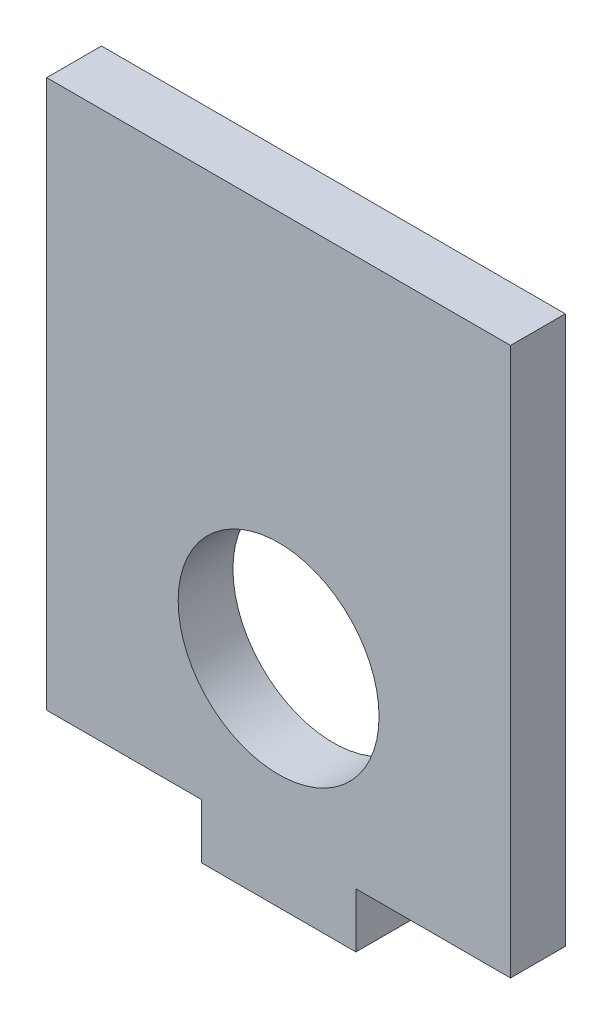
ISO-10303-21;
HEADER;
FILE_DESCRIPTION(('STEP AP214'),'2;1');
FILE_NAME('part.step','',(''),(''),'','','');
FILE_SCHEMA(('AUTOMOTIVE_DESIGN { 1 0 10303 214 1 1 1 1 }'));
ENDSEC;
DATA;
#1=APPLICATION_CONTEXT('core data for automotive mechanical design processes');
#2=APPLICATION_PROTOCOL_DEFINITION('international standard','automotive_design',2000,#1);
#3=PRODUCT_CONTEXT('',#1,'mechanical');
#4=PRODUCT('Part','Part','',(#3));
#5=PRODUCT_RELATED_PRODUCT_CATEGORY('part','',(#4));
#6=PRODUCT_DEFINITION_FORMATION('','',#4);
#7=PRODUCT_DEFINITION_CONTEXT('part definition',#1,'design');
#8=PRODUCT_DEFINITION('design','',#6,#7);
#9=PRODUCT_DEFINITION_SHAPE('','',#8);
#10=(LENGTH_UNIT() NAMED_UNIT(*) SI_UNIT(.MILLI.,.METRE.));
#11=(NAMED_UNIT(*) PLANE_ANGLE_UNIT() SI_UNIT($,.RADIAN.));
#12=(NAMED_UNIT(*) SI_UNIT($,.STERADIAN.) SOLID_ANGLE_UNIT());
#13=UNCERTAINTY_MEASURE_WITH_UNIT(LENGTH_MEASURE(1.E-05),#10,'distance_accuracy_value','');
#14=(GEOMETRIC_REPRESENTATION_CONTEXT(3) GLOBAL_UNCERTAINTY_ASSIGNED_CONTEXT((#13)) GLOBAL_UNIT_ASSIGNED_CONTEXT((#10,
#11,#12)) REPRESENTATION_CONTEXT('',''));
#15=CARTESIAN_POINT('',(0.,0.,0.));
#16=DIRECTION('',(0.,0.,1.));
#17=DIRECTION('',(1.,0.,0.));
#18=AXIS2_PLACEMENT_3D('',#15,#16,#17);
#19=CARTESIAN_POINT('',(0.,0.,6.));
#20=DIRECTION('',(0.,0.,-1.));
#21=DIRECTION('',(-1.,0.,0.));
#22=AXIS2_PLACEMENT_3D('',#19,#20,#21);
#23=PLANE('',#22);
#24=DIRECTION('',(1.,0.,0.));
#25=VECTOR('',#24,1.);
#26=CARTESIAN_POINT('',(-350.716937195697,225.798518153976,6.));
#27=LINE('',#26,#25);
#28=CARTESIAN_POINT('',(-350.716937195697,225.798518153976,6.));
#29=VERTEX_POINT('',#28);
#30=CARTESIAN_POINT('',(-333.783603862363,225.798518153976,6.));
#31=VERTEX_POINT('',#30);
#32=EDGE_CURVE('E144',#29,#31,#27,.T.);
#33=ORIENTED_EDGE('',*,*,#32,.T.);
#34=DIRECTION('',(0.,-1.,0.));
#35=VECTOR('',#34,1.);
#36=CARTESIAN_POINT('',(-333.783603862363,225.798518153976,6.));
#37=LINE('',#36,#35);
#38=CARTESIAN_POINT('',(-333.783603862363,219.798518153976,6.));
#39=VERTEX_POINT('',#38);
#40=EDGE_CURVE('E92',#31,#39,#37,.T.);
#41=ORIENTED_EDGE('',*,*,#40,.T.);
#42=DIRECTION('',(1.,0.,0.));
#43=VECTOR('',#42,1.);
#44=CARTESIAN_POINT('',(-333.783603862363,219.798518153976,6.));
#45=LINE('',#44,#43);
#46=CARTESIAN_POINT('',(-316.85027052903,219.798518153976,6.));
#47=VERTEX_POINT('',#46);
#48=EDGE_CURVE('E159',#39,#47,#45,.T.);
#49=ORIENTED_EDGE('',*,*,#48,.T.);
#50=DIRECTION('',(0.,1.,0.));
#51=VECTOR('',#50,1.);
#52=CARTESIAN_POINT('',(-316.85027052903,219.798518153976,6.));
#53=LINE('',#52,#51);
#54=CARTESIAN_POINT('',(-316.85027052903,225.798518153976,6.));
#55=VERTEX_POINT('',#54);
#56=EDGE_CURVE('E172',#47,#55,#53,.T.);
#57=ORIENTED_EDGE('',*,*,#56,.T.);
#58=DIRECTION('',(1.,0.,0.));
#59=VECTOR('',#58,1.);
#60=CARTESIAN_POINT('',(-316.85027052903,225.798518153976,6.));
#61=LINE('',#60,#59);
#62=CARTESIAN_POINT('',(-299.916937195697,225.798518153976,6.));
#63=VERTEX_POINT('',#62);
#64=EDGE_CURVE('E111',#55,#63,#61,.T.);
#65=ORIENTED_EDGE('',*,*,#64,.T.);
#66=DIRECTION('',(0.,1.,0.));
#67=VECTOR('',#66,1.);
#68=CARTESIAN_POINT('',(-299.916937195697,225.798518153976,6.));
#69=LINE('',#68,#67);
#70=CARTESIAN_POINT('',(-299.916937195697,285.798518153976,6.));
#71=VERTEX_POINT('',#70);
#72=EDGE_CURVE('E105',#63,#71,#69,.T.);
#73=ORIENTED_EDGE('',*,*,#72,.T.);
#74=DIRECTION('',(-1.,0.,0.));
#75=VECTOR('',#74,1.);
#76=CARTESIAN_POINT('',(-299.916937195697,285.798518153976,6.));
#77=LINE('',#76,#75);
#78=CARTESIAN_POINT('',(-350.716937195697,285.798518153976,6.));
#79=VERTEX_POINT('',#78);
#80=EDGE_CURVE('E109',#71,#79,#77,.T.);
#81=ORIENTED_EDGE('',*,*,#80,.T.);
#82=DIRECTION('',(0.,-1.,0.));
#83=VECTOR('',#82,1.);
#84=CARTESIAN_POINT('',(-350.716937195697,225.798518153976,6.));
#85=LINE('',#84,#83);
#86=EDGE_CURVE('E49',#79,#29,#85,.T.);
#87=ORIENTED_EDGE('',*,*,#86,.T.);
#88=EDGE_LOOP('',(#33,#41,#49,#57,#65,#73,#81,#87));
#89=FACE_BOUND('',#88,.T.);
#90=CARTESIAN_POINT('',(-325.316937195697,243.398518153976,6.));
#91=DIRECTION('',(0.,0.,1.));
#92=DIRECTION('',(1.,0.,0.));
#93=AXIS2_PLACEMENT_3D('',#90,#91,#92);
#94=CIRCLE('',#93,11.);
#95=CARTESIAN_POINT('',(-314.316937195697,243.398518153976,6.));
#96=VERTEX_POINT('',#95);
#97=EDGE_CURVE('E133',#96,#96,#94,.T.);
#98=ORIENTED_EDGE('',*,*,#97,.F.);
#99=EDGE_LOOP('',(#98));
#100=FACE_BOUND('',#99,.T.);
#101=ADVANCED_FACE('F32',(#89,#100),#23,.F.);
#102=CARTESIAN_POINT('',(0.,0.,0.));
#103=DIRECTION('',(0.,0.,-1.));
#104=DIRECTION('',(-1.,0.,0.));
#105=AXIS2_PLACEMENT_3D('',#102,#103,#104);
#106=PLANE('',#105);
#107=DIRECTION('',(1.,0.,0.));
#108=VECTOR('',#107,1.);
#109=CARTESIAN_POINT('',(-350.716937195697,225.798518153976,0.));
#110=LINE('',#109,#108);
#111=CARTESIAN_POINT('',(-350.716937195697,225.798518153976,0.));
#112=VERTEX_POINT('',#111);
#113=CARTESIAN_POINT('',(-333.783603862363,225.798518153976,0.));
#114=VERTEX_POINT('',#113);
#115=EDGE_CURVE('E129',#112,#114,#110,.T.);
#116=ORIENTED_EDGE('',*,*,#115,.F.);
#117=DIRECTION('',(0.,-1.,0.));
#118=VECTOR('',#117,1.);
#119=CARTESIAN_POINT('',(-350.716937195697,225.798518153976,0.));
#120=LINE('',#119,#118);
#121=CARTESIAN_POINT('',(-350.716937195697,285.798518153976,0.));
#122=VERTEX_POINT('',#121);
#123=EDGE_CURVE('E84',#122,#112,#120,.T.);
#124=ORIENTED_EDGE('',*,*,#123,.F.);
#125=DIRECTION('',(-1.,0.,0.));
#126=VECTOR('',#125,1.);
#127=CARTESIAN_POINT('',(-299.916937195697,285.798518153976,0.));
#128=LINE('',#127,#126);
#129=CARTESIAN_POINT('',(-299.916937195697,285.798518153976,0.));
#130=VERTEX_POINT('',#129);
#131=EDGE_CURVE('E78',#130,#122,#128,.T.);
#132=ORIENTED_EDGE('',*,*,#131,.F.);
#133=DIRECTION('',(0.,1.,0.));
#134=VECTOR('',#133,1.);
#135=CARTESIAN_POINT('',(-299.916937195697,225.798518153976,0.));
#136=LINE('',#135,#134);
#137=CARTESIAN_POINT('',(-299.916937195697,225.798518153976,0.));
#138=VERTEX_POINT('',#137);
#139=EDGE_CURVE('E119',#138,#130,#136,.T.);
#140=ORIENTED_EDGE('',*,*,#139,.F.);
#141=DIRECTION('',(1.,0.,0.));
#142=VECTOR('',#141,1.);
#143=CARTESIAN_POINT('',(-316.85027052903,225.798518153976,0.));
#144=LINE('',#143,#142);
#145=CARTESIAN_POINT('',(-316.85027052903,225.798518153976,0.));
#146=VERTEX_POINT('',#145);
#147=EDGE_CURVE('E139',#146,#138,#144,.T.);
#148=ORIENTED_EDGE('',*,*,#147,.F.);
#149=DIRECTION('',(0.,1.,0.));
#150=VECTOR('',#149,1.);
#151=CARTESIAN_POINT('',(-316.85027052903,219.798518153976,0.));
#152=LINE('',#151,#150);
#153=CARTESIAN_POINT('',(-316.85027052903,219.798518153976,0.));
#154=VERTEX_POINT('',#153);
#155=EDGE_CURVE('E137',#154,#146,#152,.T.);
#156=ORIENTED_EDGE('',*,*,#155,.F.);
#157=DIRECTION('',(1.,0.,0.));
#158=VECTOR('',#157,1.);
#159=CARTESIAN_POINT('',(-333.783603862363,219.798518153976,0.));
#160=LINE('',#159,#158);
#161=CARTESIAN_POINT('',(-333.783603862363,219.798518153976,0.));
#162=VERTEX_POINT('',#161);
#163=EDGE_CURVE('E135',#162,#154,#160,.T.);
#164=ORIENTED_EDGE('',*,*,#163,.F.);
#165=DIRECTION('',(0.,-1.,0.));
#166=VECTOR('',#165,1.);
#167=CARTESIAN_POINT('',(-333.783603862363,225.798518153976,0.));
#168=LINE('',#167,#166);
#169=EDGE_CURVE('E132',#114,#162,#168,.T.);
#170=ORIENTED_EDGE('',*,*,#169,.F.);
#171=EDGE_LOOP('',(#116,#124,#132,#140,#148,#156,#164,#170));
#172=FACE_BOUND('',#171,.T.);
#173=CARTESIAN_POINT('',(-325.316937195697,243.398518153976,0.));
#174=DIRECTION('',(0.,0.,1.));
#175=DIRECTION('',(1.,0.,0.));
#176=AXIS2_PLACEMENT_3D('',#173,#174,#175);
#177=CIRCLE('',#176,11.);
#178=CARTESIAN_POINT('',(-314.316937195697,243.398518153976,0.));
#179=VERTEX_POINT('',#178);
#180=EDGE_CURVE('E178',#179,#179,#177,.T.);
#181=ORIENTED_EDGE('',*,*,#180,.T.);
#182=EDGE_LOOP('',(#181));
#183=FACE_BOUND('',#182,.T.);
#184=ADVANCED_FACE('F163',(#172,#183),#106,.T.);
#185=CARTESIAN_POINT('',(-350.716937195697,225.798518153976,6.));
#186=DIRECTION('',(0.,1.,0.));
#187=DIRECTION('',(0.,0.,1.));
#188=AXIS2_PLACEMENT_3D('',#185,#186,#187);
#189=PLANE('',#188);
#190=ORIENTED_EDGE('',*,*,#115,.T.);
#191=DIRECTION('',(0.,0.,-1.));
#192=VECTOR('',#191,1.);
#193=CARTESIAN_POINT('',(-333.783603862363,225.798518153976,6.));
#194=LINE('',#193,#192);
#195=EDGE_CURVE('E11',#31,#114,#194,.T.);
#196=ORIENTED_EDGE('',*,*,#195,.F.);
#197=ORIENTED_EDGE('',*,*,#32,.F.);
#198=DIRECTION('',(0.,0.,-1.));
#199=VECTOR('',#198,1.);
#200=CARTESIAN_POINT('',(-350.716937195697,225.798518153976,6.));
#201=LINE('',#200,#199);
#202=EDGE_CURVE('E125',#29,#112,#201,.T.);
#203=ORIENTED_EDGE('',*,*,#202,.T.);
#204=EDGE_LOOP('',(#190,#196,#197,#203));
#205=FACE_BOUND('',#204,.T.);
#206=ADVANCED_FACE('F34',(#205),#189,.F.);
#207=CARTESIAN_POINT('',(-333.783603862363,225.798518153976,6.));
#208=DIRECTION('',(1.,0.,0.));
#209=DIRECTION('',(0.,0.,-1.));
#210=AXIS2_PLACEMENT_3D('',#207,#208,#209);
#211=PLANE('',#210);
#212=ORIENTED_EDGE('',*,*,#169,.T.);
#213=DIRECTION('',(0.,0.,-1.));
#214=VECTOR('',#213,1.);
#215=CARTESIAN_POINT('',(-333.783603862363,219.798518153976,6.));
#216=LINE('',#215,#214);
#217=EDGE_CURVE('E41',#39,#162,#216,.T.);
#218=ORIENTED_EDGE('',*,*,#217,.F.);
#219=ORIENTED_EDGE('',*,*,#40,.F.);
#220=ORIENTED_EDGE('',*,*,#195,.T.);
#221=EDGE_LOOP('',(#212,#218,#219,#220));
#222=FACE_BOUND('',#221,.T.);
#223=ADVANCED_FACE('F206',(#222),#211,.F.);
#224=CARTESIAN_POINT('',(-333.783603862363,219.798518153976,6.));
#225=DIRECTION('',(0.,1.,0.));
#226=DIRECTION('',(0.,0.,1.));
#227=AXIS2_PLACEMENT_3D('',#224,#225,#226);
#228=PLANE('',#227);
#229=ORIENTED_EDGE('',*,*,#163,.T.);
#230=DIRECTION('',(0.,0.,-1.));
#231=VECTOR('',#230,1.);
#232=CARTESIAN_POINT('',(-316.85027052903,219.798518153976,6.));
#233=LINE('',#232,#231);
#234=EDGE_CURVE('E151',#47,#154,#233,.T.);
#235=ORIENTED_EDGE('',*,*,#234,.F.);
#236=ORIENTED_EDGE('',*,*,#48,.F.);
#237=ORIENTED_EDGE('',*,*,#217,.T.);
#238=EDGE_LOOP('',(#229,#235,#236,#237));
#239=FACE_BOUND('',#238,.T.);
#240=ADVANCED_FACE('F157',(#239),#228,.F.);
#241=CARTESIAN_POINT('',(-316.85027052903,219.798518153976,6.));
#242=DIRECTION('',(-1.,0.,0.));
#243=DIRECTION('',(0.,0.,1.));
#244=AXIS2_PLACEMENT_3D('',#241,#242,#243);
#245=PLANE('',#244);
#246=ORIENTED_EDGE('',*,*,#155,.T.);
#247=DIRECTION('',(0.,0.,-1.));
#248=VECTOR('',#247,1.);
#249=CARTESIAN_POINT('',(-316.85027052903,225.798518153976,6.));
#250=LINE('',#249,#248);
#251=EDGE_CURVE('E148',#55,#146,#250,.T.);
#252=ORIENTED_EDGE('',*,*,#251,.F.);
#253=ORIENTED_EDGE('',*,*,#56,.F.);
#254=ORIENTED_EDGE('',*,*,#234,.T.);
#255=EDGE_LOOP('',(#246,#252,#253,#254));
#256=FACE_BOUND('',#255,.T.);
#257=ADVANCED_FACE('F168',(#256),#245,.F.);
#258=CARTESIAN_POINT('',(-316.85027052903,225.798518153976,6.));
#259=DIRECTION('',(0.,1.,0.));
#260=DIRECTION('',(0.,0.,1.));
#261=AXIS2_PLACEMENT_3D('',#258,#259,#260);
#262=PLANE('',#261);
#263=ORIENTED_EDGE('',*,*,#147,.T.);
#264=DIRECTION('',(0.,0.,-1.));
#265=VECTOR('',#264,1.);
#266=CARTESIAN_POINT('',(-299.916937195697,225.798518153976,6.));
#267=LINE('',#266,#265);
#268=EDGE_CURVE('E120',#63,#138,#267,.T.);
#269=ORIENTED_EDGE('',*,*,#268,.F.);
#270=ORIENTED_EDGE('',*,*,#64,.F.);
#271=ORIENTED_EDGE('',*,*,#251,.T.);
#272=EDGE_LOOP('',(#263,#269,#270,#271));
#273=FACE_BOUND('',#272,.T.);
#274=ADVANCED_FACE('F171',(#273),#262,.F.);
#275=CARTESIAN_POINT('',(-299.916937195697,225.798518153976,6.));
#276=DIRECTION('',(-1.,0.,0.));
#277=DIRECTION('',(0.,0.,1.));
#278=AXIS2_PLACEMENT_3D('',#275,#276,#277);
#279=PLANE('',#278);
#280=ORIENTED_EDGE('',*,*,#139,.T.);
#281=DIRECTION('',(0.,0.,-1.));
#282=VECTOR('',#281,1.);
#283=CARTESIAN_POINT('',(-299.916937195697,285.798518153976,6.));
#284=LINE('',#283,#282);
#285=EDGE_CURVE('E116',#71,#130,#284,.T.);
#286=ORIENTED_EDGE('',*,*,#285,.F.);
#287=ORIENTED_EDGE('',*,*,#72,.F.);
#288=ORIENTED_EDGE('',*,*,#268,.T.);
#289=EDGE_LOOP('',(#280,#286,#287,#288));
#290=FACE_BOUND('',#289,.T.);
#291=ADVANCED_FACE('F117',(#290),#279,.F.);
#292=CARTESIAN_POINT('',(-299.916937195697,285.798518153976,6.));
#293=DIRECTION('',(0.,-1.,0.));
#294=DIRECTION('',(0.,0.,-1.));
#295=AXIS2_PLACEMENT_3D('',#292,#293,#294);
#296=PLANE('',#295);
#297=ORIENTED_EDGE('',*,*,#131,.T.);
#298=DIRECTION('',(0.,0.,-1.));
#299=VECTOR('',#298,1.);
#300=CARTESIAN_POINT('',(-350.716937195697,285.798518153976,6.));
#301=LINE('',#300,#299);
#302=EDGE_CURVE('E121',#79,#122,#301,.T.);
#303=ORIENTED_EDGE('',*,*,#302,.F.);
#304=ORIENTED_EDGE('',*,*,#80,.F.);
#305=ORIENTED_EDGE('',*,*,#285,.T.);
#306=EDGE_LOOP('',(#297,#303,#304,#305));
#307=FACE_BOUND('',#306,.T.);
#308=ADVANCED_FACE('F123',(#307),#296,.F.);
#309=CARTESIAN_POINT('',(-350.716937195697,225.798518153976,6.));
#310=DIRECTION('',(1.,0.,0.));
#311=DIRECTION('',(0.,0.,-1.));
#312=AXIS2_PLACEMENT_3D('',#309,#310,#311);
#313=PLANE('',#312);
#314=ORIENTED_EDGE('',*,*,#123,.T.);
#315=ORIENTED_EDGE('',*,*,#202,.F.);
#316=ORIENTED_EDGE('',*,*,#86,.F.);
#317=ORIENTED_EDGE('',*,*,#302,.T.);
#318=EDGE_LOOP('',(#314,#315,#316,#317));
#319=FACE_BOUND('',#318,.T.);
#320=ADVANCED_FACE('F194',(#319),#313,.F.);
#321=CARTESIAN_POINT('',(-325.316937195697,243.398518153976,6.));
#322=DIRECTION('',(0.,0.,-1.));
#323=DIRECTION('',(-1.,0.,0.));
#324=AXIS2_PLACEMENT_3D('',#321,#322,#323);
#325=CYLINDRICAL_SURFACE('',#324,11.);
#326=ORIENTED_EDGE('',*,*,#97,.T.);
#327=EDGE_LOOP('',(#326));
#328=FACE_BOUND('',#327,.T.);
#329=ORIENTED_EDGE('',*,*,#180,.F.);
#330=EDGE_LOOP('',(#329));
#331=FACE_BOUND('',#330,.T.);
#332=ADVANCED_FACE('F184',(#328,#331),#325,.F.);
#333=CLOSED_SHELL('',(#101,#184,#206,#223,#240,#257,#274,#291,#308,#320,#332));
#334=MANIFOLD_SOLID_BREP('B2',#333);
#335=ADVANCED_BREP_SHAPE_REPRESENTATION('',(#18,#334),#14);
#336=SHAPE_DEFINITION_REPRESENTATION(#9,#335);
ENDSEC;
END-ISO-10303-21;
